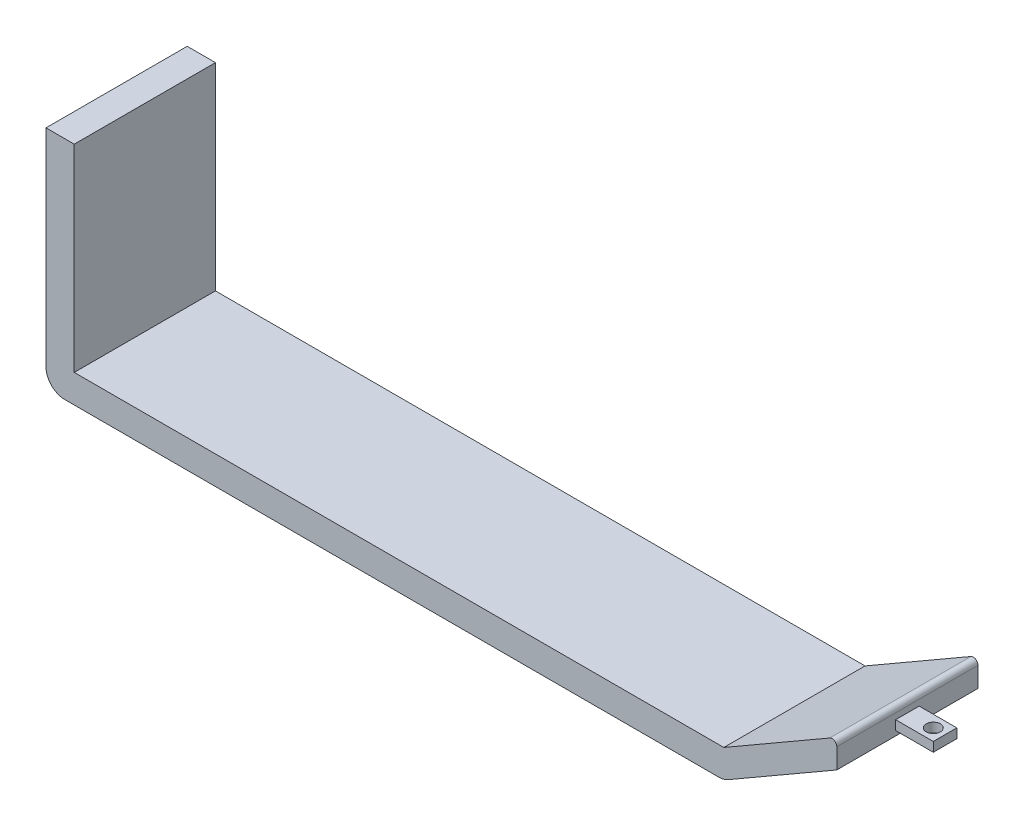
ISO-10303-21;
HEADER;
FILE_DESCRIPTION(('STEP AP214'),'2;1');
FILE_NAME('part.step','',(''),(''),'','','');
FILE_SCHEMA(('AUTOMOTIVE_DESIGN { 1 0 10303 214 1 1 1 1 }'));
ENDSEC;
DATA;
#1=APPLICATION_CONTEXT('core data for automotive mechanical design processes');
#2=APPLICATION_PROTOCOL_DEFINITION('international standard','automotive_design',2000,#1);
#3=PRODUCT_CONTEXT('',#1,'mechanical');
#4=PRODUCT('Part','Part','',(#3));
#5=PRODUCT_RELATED_PRODUCT_CATEGORY('part','',(#4));
#6=PRODUCT_DEFINITION_FORMATION('','',#4);
#7=PRODUCT_DEFINITION_CONTEXT('part definition',#1,'design');
#8=PRODUCT_DEFINITION('design','',#6,#7);
#9=PRODUCT_DEFINITION_SHAPE('','',#8);
#10=(LENGTH_UNIT() NAMED_UNIT(*) SI_UNIT(.MILLI.,.METRE.));
#11=(NAMED_UNIT(*) PLANE_ANGLE_UNIT() SI_UNIT($,.RADIAN.));
#12=(NAMED_UNIT(*) SI_UNIT($,.STERADIAN.) SOLID_ANGLE_UNIT());
#13=UNCERTAINTY_MEASURE_WITH_UNIT(LENGTH_MEASURE(1.E-05),#10,'distance_accuracy_value','');
#14=(GEOMETRIC_REPRESENTATION_CONTEXT(3) GLOBAL_UNCERTAINTY_ASSIGNED_CONTEXT((#13)) GLOBAL_UNIT_ASSIGNED_CONTEXT((#10,
#11,#12)) REPRESENTATION_CONTEXT('',''));
#15=CARTESIAN_POINT('',(0.,0.,0.));
#16=DIRECTION('',(0.,0.,1.));
#17=DIRECTION('',(1.,0.,0.));
#18=AXIS2_PLACEMENT_3D('',#15,#16,#17);
#19=CARTESIAN_POINT('',(2133.6,2.48689957516037E-11,381.));
#20=DIRECTION('',(-1.,0.,0.));
#21=DIRECTION('',(0.,-1.,0.));
#22=AXIS2_PLACEMENT_3D('',#19,#20,#21);
#23=PLANE('',#22);
#24=DIRECTION('',(0.,1.,0.));
#25=VECTOR('',#24,1.);
#26=CARTESIAN_POINT('',(2133.6,2.48689957516037E-11,0.));
#27=LINE('',#26,#25);
#28=CARTESIAN_POINT('',(2133.6,175.976362048999,0.));
#29=VERTEX_POINT('',#28);
#30=CARTESIAN_POINT('',(2133.6,230.179316792874,0.));
#31=VERTEX_POINT('',#30);
#32=EDGE_CURVE('E253',#29,#31,#27,.T.);
#33=ORIENTED_EDGE('',*,*,#32,.T.);
#34=DIRECTION('',(0.,0.,-1.));
#35=VECTOR('',#34,1.);
#36=CARTESIAN_POINT('',(2133.6,230.179316792874,381.));
#37=LINE('',#36,#35);
#38=CARTESIAN_POINT('',(2133.6,230.179316792874,381.));
#39=VERTEX_POINT('',#38);
#40=EDGE_CURVE('E298',#31,#39,#37,.F.);
#41=ORIENTED_EDGE('',*,*,#40,.T.);
#42=DIRECTION('',(0.,1.,0.));
#43=VECTOR('',#42,1.);
#44=CARTESIAN_POINT('',(2133.6,2.48689957516037E-11,381.));
#45=LINE('',#44,#43);
#46=CARTESIAN_POINT('',(2133.6,175.976362048999,381.));
#47=VERTEX_POINT('',#46);
#48=EDGE_CURVE('E232',#47,#39,#45,.T.);
#49=ORIENTED_EDGE('',*,*,#48,.F.);
#50=DIRECTION('',(0.,0.,-1.));
#51=VECTOR('',#50,1.);
#52=CARTESIAN_POINT('',(2133.6,175.976362048999,381.));
#53=LINE('',#52,#51);
#54=EDGE_CURVE('E279',#47,#29,#53,.T.);
#55=ORIENTED_EDGE('',*,*,#54,.T.);
#56=EDGE_LOOP('',(#33,#41,#49,#55));
#57=FACE_BOUND('',#56,.T.);
#58=DIRECTION('',(0.,-1.,0.));
#59=VECTOR('',#58,1.);
#60=CARTESIAN_POINT('',(2133.6,188.676362048999,222.25));
#61=LINE('',#60,#59);
#62=CARTESIAN_POINT('',(2133.6,214.076362048999,222.25));
#63=VERTEX_POINT('',#62);
#64=CARTESIAN_POINT('',(2133.6,188.676362048999,222.25));
#65=VERTEX_POINT('',#64);
#66=EDGE_CURVE('E187',#63,#65,#61,.T.);
#67=ORIENTED_EDGE('',*,*,#66,.F.);
#68=DIRECTION('',(0.,0.,1.));
#69=VECTOR('',#68,1.);
#70=CARTESIAN_POINT('',(2133.6,214.076362048999,222.25));
#71=LINE('',#70,#69);
#72=CARTESIAN_POINT('',(2133.6,214.076362048999,158.75));
#73=VERTEX_POINT('',#72);
#74=EDGE_CURVE('E184',#73,#63,#71,.T.);
#75=ORIENTED_EDGE('',*,*,#74,.F.);
#76=DIRECTION('',(0.,1.,0.));
#77=VECTOR('',#76,1.);
#78=CARTESIAN_POINT('',(2133.6,188.676362048999,158.75));
#79=LINE('',#78,#77);
#80=CARTESIAN_POINT('',(2133.6,188.676362048999,158.75));
#81=VERTEX_POINT('',#80);
#82=EDGE_CURVE('E57',#81,#73,#79,.T.);
#83=ORIENTED_EDGE('',*,*,#82,.F.);
#84=DIRECTION('',(0.,0.,-1.));
#85=VECTOR('',#84,1.);
#86=CARTESIAN_POINT('',(2133.6,188.676362048999,222.25));
#87=LINE('',#86,#85);
#88=EDGE_CURVE('E52',#65,#81,#87,.T.);
#89=ORIENTED_EDGE('',*,*,#88,.F.);
#90=EDGE_LOOP('',(#67,#75,#83,#89));
#91=FACE_BOUND('',#90,.T.);
#92=ADVANCED_FACE('F37',(#57,#91),#23,.F.);
#93=CARTESIAN_POINT('',(0.,0.,381.));
#94=DIRECTION('',(-1.,0.,0.));
#95=DIRECTION('',(0.,0.,1.));
#96=AXIS2_PLACEMENT_3D('',#93,#94,#95);
#97=PLANE('',#96);
#98=DIRECTION('',(0.,1.,0.));
#99=VECTOR('',#98,1.);
#100=CARTESIAN_POINT('',(0.,0.,0.));
#101=LINE('',#100,#99);
#102=CARTESIAN_POINT('',(0.,50.8,0.));
#103=VERTEX_POINT('',#102);
#104=CARTESIAN_POINT('',(0.,609.6,0.));
#105=VERTEX_POINT('',#104);
#106=EDGE_CURVE('E268',#103,#105,#101,.T.);
#107=ORIENTED_EDGE('',*,*,#106,.F.);
#108=DIRECTION('',(0.,0.,-1.));
#109=VECTOR('',#108,1.);
#110=CARTESIAN_POINT('',(0.,50.8,381.));
#111=LINE('',#110,#109);
#112=CARTESIAN_POINT('',(0.,50.8,158.75));
#113=VERTEX_POINT('',#112);
#114=EDGE_CURVE('E45',#103,#113,#111,.F.);
#115=ORIENTED_EDGE('',*,*,#114,.T.);
#116=DIRECTION('',(0.,-1.,0.));
#117=VECTOR('',#116,1.);
#118=CARTESIAN_POINT('',(0.,50.8,158.75));
#119=LINE('',#118,#117);
#120=CARTESIAN_POINT('',(0.,76.2,158.75));
#121=VERTEX_POINT('',#120);
#122=EDGE_CURVE('E199',#121,#113,#119,.T.);
#123=ORIENTED_EDGE('',*,*,#122,.F.);
#124=DIRECTION('',(0.,0.,-1.));
#125=VECTOR('',#124,1.);
#126=CARTESIAN_POINT('',(0.,76.2,158.75));
#127=LINE('',#126,#125);
#128=CARTESIAN_POINT('',(0.,76.2,222.25));
#129=VERTEX_POINT('',#128);
#130=EDGE_CURVE('E204',#129,#121,#127,.T.);
#131=ORIENTED_EDGE('',*,*,#130,.F.);
#132=DIRECTION('',(0.,1.,0.));
#133=VECTOR('',#132,1.);
#134=CARTESIAN_POINT('',(0.,50.8,222.25));
#135=LINE('',#134,#133);
#136=CARTESIAN_POINT('',(0.,50.8,222.25));
#137=VERTEX_POINT('',#136);
#138=EDGE_CURVE('E215',#137,#129,#135,.T.);
#139=ORIENTED_EDGE('',*,*,#138,.F.);
#140=DIRECTION('',(0.,0.,-1.));
#141=VECTOR('',#140,1.);
#142=CARTESIAN_POINT('',(0.,50.8,381.));
#143=LINE('',#142,#141);
#144=CARTESIAN_POINT('',(0.,50.8,381.));
#145=VERTEX_POINT('',#144);
#146=EDGE_CURVE('E307',#137,#145,#143,.F.);
#147=ORIENTED_EDGE('',*,*,#146,.T.);
#148=DIRECTION('',(0.,1.,0.));
#149=VECTOR('',#148,1.);
#150=CARTESIAN_POINT('',(0.,0.,381.));
#151=LINE('',#150,#149);
#152=CARTESIAN_POINT('',(0.,609.6,381.));
#153=VERTEX_POINT('',#152);
#154=EDGE_CURVE('E247',#145,#153,#151,.T.);
#155=ORIENTED_EDGE('',*,*,#154,.T.);
#156=DIRECTION('',(0.,0.,-1.));
#157=VECTOR('',#156,1.);
#158=CARTESIAN_POINT('',(0.,609.6,381.));
#159=LINE('',#158,#157);
#160=EDGE_CURVE('E251',#153,#105,#159,.T.);
#161=ORIENTED_EDGE('',*,*,#160,.T.);
#162=EDGE_LOOP('',(#107,#115,#123,#131,#139,#147,#155,#161));
#163=FACE_BOUND('',#162,.T.);
#164=ADVANCED_FACE('F312',(#163),#97,.T.);
#165=CARTESIAN_POINT('',(457.200000000003,-791.893629220492,381.));
#166=DIRECTION('',(-0.500000000000001,0.866025403784438,0.));
#167=DIRECTION('',(-0.866025403784438,-0.500000000000002,0.));
#168=AXIS2_PLACEMENT_3D('',#165,#166,#167);
#169=PLANE('',#168);
#170=DIRECTION('',(0.866025403784438,0.500000000000002,0.));
#171=VECTOR('',#170,1.);
#172=CARTESIAN_POINT('',(457.200000000003,-791.893629220492,381.));
#173=LINE('',#172,#171);
#174=CARTESIAN_POINT('',(1840.5881810245,6.80590948775051,381.));
#175=VERTEX_POINT('',#174);
#176=EDGE_CURVE('E230',#175,#47,#173,.T.);
#177=ORIENTED_EDGE('',*,*,#176,.F.);
#178=DIRECTION('',(0.,0.,-1.));
#179=VECTOR('',#178,1.);
#180=CARTESIAN_POINT('',(1840.5881810245,6.80590948775062,381.));
#181=LINE('',#180,#179);
#182=CARTESIAN_POINT('',(1840.5881810245,6.80590948775051,0.));
#183=VERTEX_POINT('',#182);
#184=EDGE_CURVE('E282',#175,#183,#181,.T.);
#185=ORIENTED_EDGE('',*,*,#184,.T.);
#186=DIRECTION('',(0.866025403784438,0.500000000000002,0.));
#187=VECTOR('',#186,1.);
#188=CARTESIAN_POINT('',(457.200000000003,-791.893629220492,0.));
#189=LINE('',#188,#187);
#190=EDGE_CURVE('E229',#183,#29,#189,.T.);
#191=ORIENTED_EDGE('',*,*,#190,.T.);
#192=ORIENTED_EDGE('',*,*,#54,.F.);
#193=EDGE_LOOP('',(#177,#185,#191,#192));
#194=FACE_BOUND('',#193,.T.);
#195=ADVANCED_FACE('F355',(#194),#169,.F.);
#196=CARTESIAN_POINT('',(424.204432115816,-734.743629220493,381.));
#197=DIRECTION('',(-0.500000000000001,0.866025403784438,0.));
#198=DIRECTION('',(-0.866025403784438,-0.500000000000002,0.));
#199=AXIS2_PLACEMENT_3D('',#196,#197,#198);
#200=PLANE('',#199);
#201=DIRECTION('',(0.866025403784438,0.500000000000002,0.));
#202=VECTOR('',#201,1.);
#203=CARTESIAN_POINT('',(424.204432115816,-734.743629220493,381.));
#204=LINE('',#203,#202);
#205=CARTESIAN_POINT('',(1828.8,76.2,381.));
#206=VERTEX_POINT('',#205);
#207=CARTESIAN_POINT('',(2114.55,241.177839420936,381.));
#208=VERTEX_POINT('',#207);
#209=EDGE_CURVE('E236',#206,#208,#204,.T.);
#210=ORIENTED_EDGE('',*,*,#209,.T.);
#211=DIRECTION('',(0.,0.,-1.));
#212=VECTOR('',#211,1.);
#213=CARTESIAN_POINT('',(2114.55,241.177839420936,0.));
#214=LINE('',#213,#212);
#215=CARTESIAN_POINT('',(2114.55,241.177839420936,0.));
#216=VERTEX_POINT('',#215);
#217=EDGE_CURVE('E293',#208,#216,#214,.T.);
#218=ORIENTED_EDGE('',*,*,#217,.T.);
#219=DIRECTION('',(0.866025403784438,0.500000000000002,0.));
#220=VECTOR('',#219,1.);
#221=CARTESIAN_POINT('',(424.204432115816,-734.743629220493,0.));
#222=LINE('',#221,#220);
#223=CARTESIAN_POINT('',(1828.8,76.2,0.));
#224=VERTEX_POINT('',#223);
#225=EDGE_CURVE('E256',#224,#216,#222,.T.);
#226=ORIENTED_EDGE('',*,*,#225,.F.);
#227=DIRECTION('',(0.,0.,-1.));
#228=VECTOR('',#227,1.);
#229=CARTESIAN_POINT('',(1828.8,76.2,381.));
#230=LINE('',#229,#228);
#231=EDGE_CURVE('E277',#206,#224,#230,.T.);
#232=ORIENTED_EDGE('',*,*,#231,.F.);
#233=EDGE_LOOP('',(#210,#218,#226,#232));
#234=FACE_BOUND('',#233,.T.);
#235=ADVANCED_FACE('F368',(#234),#200,.T.);
#236=CARTESIAN_POINT('',(0.,76.2,381.));
#237=DIRECTION('',(0.,1.,0.));
#238=DIRECTION('',(0.,0.,1.));
#239=AXIS2_PLACEMENT_3D('',#236,#237,#238);
#240=PLANE('',#239);
#241=DIRECTION('',(1.,0.,0.));
#242=VECTOR('',#241,1.);
#243=CARTESIAN_POINT('',(0.,76.2,0.));
#244=LINE('',#243,#242);
#245=CARTESIAN_POINT('',(76.2,76.2,0.));
#246=VERTEX_POINT('',#245);
#247=EDGE_CURVE('E259',#246,#224,#244,.T.);
#248=ORIENTED_EDGE('',*,*,#247,.F.);
#249=DIRECTION('',(0.,0.,-1.));
#250=VECTOR('',#249,1.);
#251=CARTESIAN_POINT('',(76.2,76.2,381.));
#252=LINE('',#251,#250);
#253=CARTESIAN_POINT('',(76.2,76.2,381.));
#254=VERTEX_POINT('',#253);
#255=EDGE_CURVE('E275',#254,#246,#252,.T.);
#256=ORIENTED_EDGE('',*,*,#255,.F.);
#257=DIRECTION('',(1.,0.,0.));
#258=VECTOR('',#257,1.);
#259=CARTESIAN_POINT('',(0.,76.2,381.));
#260=LINE('',#259,#258);
#261=EDGE_CURVE('E239',#254,#206,#260,.T.);
#262=ORIENTED_EDGE('',*,*,#261,.T.);
#263=ORIENTED_EDGE('',*,*,#231,.T.);
#264=EDGE_LOOP('',(#248,#256,#262,#263));
#265=FACE_BOUND('',#264,.T.);
#266=ADVANCED_FACE('F370',(#265),#240,.T.);
#267=CARTESIAN_POINT('',(76.2,0.,381.));
#268=DIRECTION('',(-1.,0.,0.));
#269=DIRECTION('',(0.,0.,1.));
#270=AXIS2_PLACEMENT_3D('',#267,#268,#269);
#271=PLANE('',#270);
#272=DIRECTION('',(0.,1.,0.));
#273=VECTOR('',#272,1.);
#274=CARTESIAN_POINT('',(76.2,0.,0.));
#275=LINE('',#274,#273);
#276=CARTESIAN_POINT('',(76.2,609.6,0.));
#277=VERTEX_POINT('',#276);
#278=EDGE_CURVE('E262',#246,#277,#275,.T.);
#279=ORIENTED_EDGE('',*,*,#278,.T.);
#280=DIRECTION('',(0.,0.,-1.));
#281=VECTOR('',#280,1.);
#282=CARTESIAN_POINT('',(76.2,609.6,381.));
#283=LINE('',#282,#281);
#284=CARTESIAN_POINT('',(76.2,609.6,381.));
#285=VERTEX_POINT('',#284);
#286=EDGE_CURVE('E273',#285,#277,#283,.T.);
#287=ORIENTED_EDGE('',*,*,#286,.F.);
#288=DIRECTION('',(0.,1.,0.));
#289=VECTOR('',#288,1.);
#290=CARTESIAN_POINT('',(76.2,0.,381.));
#291=LINE('',#290,#289);
#292=EDGE_CURVE('E242',#254,#285,#291,.T.);
#293=ORIENTED_EDGE('',*,*,#292,.F.);
#294=ORIENTED_EDGE('',*,*,#255,.T.);
#295=EDGE_LOOP('',(#279,#287,#293,#294));
#296=FACE_BOUND('',#295,.T.);
#297=ADVANCED_FACE('F372',(#296),#271,.F.);
#298=CARTESIAN_POINT('',(0.,609.6,381.));
#299=DIRECTION('',(0.,1.,0.));
#300=DIRECTION('',(0.,0.,1.));
#301=AXIS2_PLACEMENT_3D('',#298,#299,#300);
#302=PLANE('',#301);
#303=DIRECTION('',(1.,0.,0.));
#304=VECTOR('',#303,1.);
#305=CARTESIAN_POINT('',(0.,609.6,0.));
#306=LINE('',#305,#304);
#307=EDGE_CURVE('E265',#105,#277,#306,.T.);
#308=ORIENTED_EDGE('',*,*,#307,.F.);
#309=ORIENTED_EDGE('',*,*,#160,.F.);
#310=DIRECTION('',(1.,0.,0.));
#311=VECTOR('',#310,1.);
#312=CARTESIAN_POINT('',(0.,609.6,381.));
#313=LINE('',#312,#311);
#314=EDGE_CURVE('E244',#153,#285,#313,.T.);
#315=ORIENTED_EDGE('',*,*,#314,.T.);
#316=ORIENTED_EDGE('',*,*,#286,.T.);
#317=EDGE_LOOP('',(#308,#309,#315,#316));
#318=FACE_BOUND('',#317,.T.);
#319=ADVANCED_FACE('F339',(#318),#302,.T.);
#320=CARTESIAN_POINT('',(0.,0.,381.));
#321=DIRECTION('',(0.,1.,0.));
#322=DIRECTION('',(0.,0.,1.));
#323=AXIS2_PLACEMENT_3D('',#320,#321,#322);
#324=PLANE('',#323);
#325=DIRECTION('',(1.,0.,0.));
#326=VECTOR('',#325,1.);
#327=CARTESIAN_POINT('',(0.,0.,381.));
#328=LINE('',#327,#326);
#329=CARTESIAN_POINT('',(50.8,0.,381.));
#330=VERTEX_POINT('',#329);
#331=CARTESIAN_POINT('',(1815.1881810245,0.,381.));
#332=VERTEX_POINT('',#331);
#333=EDGE_CURVE('E249',#330,#332,#328,.T.);
#334=ORIENTED_EDGE('',*,*,#333,.F.);
#335=DIRECTION('',(0.,0.,-1.));
#336=VECTOR('',#335,1.);
#337=CARTESIAN_POINT('',(50.8,0.,0.));
#338=LINE('',#337,#336);
#339=CARTESIAN_POINT('',(50.8,0.,0.));
#340=VERTEX_POINT('',#339);
#341=EDGE_CURVE('E302',#330,#340,#338,.T.);
#342=ORIENTED_EDGE('',*,*,#341,.T.);
#343=DIRECTION('',(1.,0.,0.));
#344=VECTOR('',#343,1.);
#345=CARTESIAN_POINT('',(0.,0.,0.));
#346=LINE('',#345,#344);
#347=CARTESIAN_POINT('',(1815.1881810245,0.,0.));
#348=VERTEX_POINT('',#347);
#349=EDGE_CURVE('E233',#340,#348,#346,.T.);
#350=ORIENTED_EDGE('',*,*,#349,.T.);
#351=DIRECTION('',(0.,0.,-1.));
#352=VECTOR('',#351,1.);
#353=CARTESIAN_POINT('',(1815.1881810245,0.,381.));
#354=LINE('',#353,#352);
#355=EDGE_CURVE('E288',#348,#332,#354,.F.);
#356=ORIENTED_EDGE('',*,*,#355,.T.);
#357=EDGE_LOOP('',(#334,#342,#350,#356));
#358=FACE_BOUND('',#357,.T.);
#359=ADVANCED_FACE('F346',(#358),#324,.F.);
#360=CARTESIAN_POINT('',(0.,0.,381.));
#361=DIRECTION('',(0.,0.,1.));
#362=DIRECTION('',(1.,0.,0.));
#363=AXIS2_PLACEMENT_3D('',#360,#361,#362);
#364=PLANE('',#363);
#365=ORIENTED_EDGE('',*,*,#154,.F.);
#366=CARTESIAN_POINT('',(50.8,50.8,381.));
#367=DIRECTION('',(0.,0.,1.));
#368=DIRECTION('',(1.,0.,0.));
#369=AXIS2_PLACEMENT_3D('',#366,#367,#368);
#370=CIRCLE('',#369,50.8);
#371=EDGE_CURVE('E11',#145,#330,#370,.T.);
#372=ORIENTED_EDGE('',*,*,#371,.T.);
#373=ORIENTED_EDGE('',*,*,#333,.T.);
#374=CARTESIAN_POINT('',(1815.1881810245,50.8,381.));
#375=DIRECTION('',(0.,0.,1.));
#376=DIRECTION('',(1.,0.,0.));
#377=AXIS2_PLACEMENT_3D('',#374,#375,#376);
#378=CIRCLE('',#377,50.8);
#379=EDGE_CURVE('E291',#332,#175,#378,.T.);
#380=ORIENTED_EDGE('',*,*,#379,.T.);
#381=ORIENTED_EDGE('',*,*,#176,.T.);
#382=ORIENTED_EDGE('',*,*,#48,.T.);
#383=CARTESIAN_POINT('',(2120.9,230.179316792873,381.));
#384=DIRECTION('',(0.,0.,1.));
#385=DIRECTION('',(1.,0.,0.));
#386=AXIS2_PLACEMENT_3D('',#383,#384,#385);
#387=CIRCLE('',#386,12.7);
#388=EDGE_CURVE('E300',#39,#208,#387,.T.);
#389=ORIENTED_EDGE('',*,*,#388,.T.);
#390=ORIENTED_EDGE('',*,*,#209,.F.);
#391=ORIENTED_EDGE('',*,*,#261,.F.);
#392=ORIENTED_EDGE('',*,*,#292,.T.);
#393=ORIENTED_EDGE('',*,*,#314,.F.);
#394=EDGE_LOOP('',(#365,#372,#373,#380,#381,#382,#389,#390,#391,#392,#393));
#395=FACE_BOUND('',#394,.T.);
#396=ADVANCED_FACE('F332',(#395),#364,.T.);
#397=CARTESIAN_POINT('',(0.,0.,0.));
#398=DIRECTION('',(0.,0.,1.));
#399=DIRECTION('',(1.,0.,0.));
#400=AXIS2_PLACEMENT_3D('',#397,#398,#399);
#401=PLANE('',#400);
#402=ORIENTED_EDGE('',*,*,#349,.F.);
#403=CARTESIAN_POINT('',(50.8,50.8,0.));
#404=DIRECTION('',(0.,0.,1.));
#405=DIRECTION('',(1.,0.,0.));
#406=AXIS2_PLACEMENT_3D('',#403,#404,#405);
#407=CIRCLE('',#406,50.8);
#408=EDGE_CURVE('E305',#340,#103,#407,.F.);
#409=ORIENTED_EDGE('',*,*,#408,.T.);
#410=ORIENTED_EDGE('',*,*,#106,.T.);
#411=ORIENTED_EDGE('',*,*,#307,.T.);
#412=ORIENTED_EDGE('',*,*,#278,.F.);
#413=ORIENTED_EDGE('',*,*,#247,.T.);
#414=ORIENTED_EDGE('',*,*,#225,.T.);
#415=CARTESIAN_POINT('',(2120.9,230.179316792873,0.));
#416=DIRECTION('',(0.,0.,1.));
#417=DIRECTION('',(1.,0.,0.));
#418=AXIS2_PLACEMENT_3D('',#415,#416,#417);
#419=CIRCLE('',#418,12.7);
#420=EDGE_CURVE('E296',#216,#31,#419,.F.);
#421=ORIENTED_EDGE('',*,*,#420,.T.);
#422=ORIENTED_EDGE('',*,*,#32,.F.);
#423=ORIENTED_EDGE('',*,*,#190,.F.);
#424=CARTESIAN_POINT('',(1815.1881810245,50.8,0.));
#425=DIRECTION('',(0.,0.,1.));
#426=DIRECTION('',(1.,0.,0.));
#427=AXIS2_PLACEMENT_3D('',#424,#425,#426);
#428=CIRCLE('',#427,50.8);
#429=EDGE_CURVE('E285',#183,#348,#428,.F.);
#430=ORIENTED_EDGE('',*,*,#429,.T.);
#431=EDGE_LOOP('',(#402,#409,#410,#411,#412,#413,#414,#421,#422,#423,#430));
#432=FACE_BOUND('',#431,.T.);
#433=ADVANCED_FACE('F343',(#432),#401,.F.);
#434=CARTESIAN_POINT('',(-101.6,50.8,158.75));
#435=DIRECTION('',(0.,0.,1.));
#436=DIRECTION('',(1.,0.,0.));
#437=AXIS2_PLACEMENT_3D('',#434,#435,#436);
#438=PLANE('',#437);
#439=ORIENTED_EDGE('',*,*,#122,.T.);
#440=DIRECTION('',(1.,0.,0.));
#441=VECTOR('',#440,1.);
#442=CARTESIAN_POINT('',(-101.6,50.8,158.75));
#443=LINE('',#442,#441);
#444=CARTESIAN_POINT('',(-101.6,50.8,158.75));
#445=VERTEX_POINT('',#444);
#446=EDGE_CURVE('E226',#445,#113,#443,.T.);
#447=ORIENTED_EDGE('',*,*,#446,.F.);
#448=DIRECTION('',(0.,-1.,0.));
#449=VECTOR('',#448,1.);
#450=CARTESIAN_POINT('',(-101.6,50.8,158.75));
#451=LINE('',#450,#449);
#452=CARTESIAN_POINT('',(-101.6,76.2,158.75));
#453=VERTEX_POINT('',#452);
#454=EDGE_CURVE('E200',#453,#445,#451,.T.);
#455=ORIENTED_EDGE('',*,*,#454,.F.);
#456=DIRECTION('',(1.,0.,0.));
#457=VECTOR('',#456,1.);
#458=CARTESIAN_POINT('',(-101.6,76.2,158.75));
#459=LINE('',#458,#457);
#460=EDGE_CURVE('E210',#453,#121,#459,.T.);
#461=ORIENTED_EDGE('',*,*,#460,.T.);
#462=EDGE_LOOP('',(#439,#447,#455,#461));
#463=FACE_BOUND('',#462,.T.);
#464=ADVANCED_FACE('F322',(#463),#438,.F.);
#465=CARTESIAN_POINT('',(-101.6,50.8,158.75));
#466=DIRECTION('',(0.,1.,0.));
#467=DIRECTION('',(0.,0.,1.));
#468=AXIS2_PLACEMENT_3D('',#465,#466,#467);
#469=PLANE('',#468);
#470=CARTESIAN_POINT('',(-63.5,50.8,190.5));
#471=DIRECTION('',(0.,1.,0.));
#472=DIRECTION('',(0.,0.,1.));
#473=AXIS2_PLACEMENT_3D('',#470,#471,#472);
#474=CIRCLE('',#473,19.05);
#475=CARTESIAN_POINT('',(-63.5,50.8,209.55));
#476=VERTEX_POINT('',#475);
#477=EDGE_CURVE('E191',#476,#476,#474,.F.);
#478=ORIENTED_EDGE('',*,*,#477,.F.);
#479=EDGE_LOOP('',(#478));
#480=FACE_BOUND('',#479,.T.);
#481=DIRECTION('',(0.,0.,1.));
#482=VECTOR('',#481,1.);
#483=CARTESIAN_POINT('',(0.,50.8,158.75));
#484=LINE('',#483,#482);
#485=EDGE_CURVE('E213',#113,#137,#484,.T.);
#486=ORIENTED_EDGE('',*,*,#485,.T.);
#487=DIRECTION('',(1.,0.,0.));
#488=VECTOR('',#487,1.);
#489=CARTESIAN_POINT('',(-101.6,50.8,222.25));
#490=LINE('',#489,#488);
#491=CARTESIAN_POINT('',(-101.6,50.8,222.25));
#492=VERTEX_POINT('',#491);
#493=EDGE_CURVE('E223',#492,#137,#490,.T.);
#494=ORIENTED_EDGE('',*,*,#493,.F.);
#495=DIRECTION('',(0.,0.,1.));
#496=VECTOR('',#495,1.);
#497=CARTESIAN_POINT('',(-101.6,50.8,158.75));
#498=LINE('',#497,#496);
#499=EDGE_CURVE('E203',#445,#492,#498,.T.);
#500=ORIENTED_EDGE('',*,*,#499,.F.);
#501=ORIENTED_EDGE('',*,*,#446,.T.);
#502=EDGE_LOOP('',(#486,#494,#500,#501));
#503=FACE_BOUND('',#502,.T.);
#504=ADVANCED_FACE('F318',(#480,#503),#469,.F.);
#505=CARTESIAN_POINT('',(-101.6,50.8,222.25));
#506=DIRECTION('',(0.,0.,-1.));
#507=DIRECTION('',(0.,1.,0.));
#508=AXIS2_PLACEMENT_3D('',#505,#506,#507);
#509=PLANE('',#508);
#510=ORIENTED_EDGE('',*,*,#138,.T.);
#511=DIRECTION('',(1.,0.,0.));
#512=VECTOR('',#511,1.);
#513=CARTESIAN_POINT('',(-101.6,76.2,222.25));
#514=LINE('',#513,#512);
#515=CARTESIAN_POINT('',(-101.6,76.2,222.25));
#516=VERTEX_POINT('',#515);
#517=EDGE_CURVE('E221',#516,#129,#514,.T.);
#518=ORIENTED_EDGE('',*,*,#517,.F.);
#519=DIRECTION('',(0.,1.,0.));
#520=VECTOR('',#519,1.);
#521=CARTESIAN_POINT('',(-101.6,50.8,222.25));
#522=LINE('',#521,#520);
#523=EDGE_CURVE('E206',#492,#516,#522,.T.);
#524=ORIENTED_EDGE('',*,*,#523,.F.);
#525=ORIENTED_EDGE('',*,*,#493,.T.);
#526=EDGE_LOOP('',(#510,#518,#524,#525));
#527=FACE_BOUND('',#526,.T.);
#528=ADVANCED_FACE('F419',(#527),#509,.F.);
#529=CARTESIAN_POINT('',(-101.6,76.2,158.75));
#530=DIRECTION('',(0.,-1.,0.));
#531=DIRECTION('',(0.,0.,-1.));
#532=AXIS2_PLACEMENT_3D('',#529,#530,#531);
#533=PLANE('',#532);
#534=CARTESIAN_POINT('',(-63.5,76.1999999999999,190.5));
#535=DIRECTION('',(0.,1.,0.));
#536=DIRECTION('',(0.,0.,1.));
#537=AXIS2_PLACEMENT_3D('',#534,#535,#536);
#538=CIRCLE('',#537,19.05);
#539=CARTESIAN_POINT('',(-63.5,76.1999999999999,209.55));
#540=VERTEX_POINT('',#539);
#541=EDGE_CURVE('E188',#540,#540,#538,.T.);
#542=ORIENTED_EDGE('',*,*,#541,.F.);
#543=EDGE_LOOP('',(#542));
#544=FACE_BOUND('',#543,.T.);
#545=ORIENTED_EDGE('',*,*,#130,.T.);
#546=ORIENTED_EDGE('',*,*,#460,.F.);
#547=DIRECTION('',(0.,0.,-1.));
#548=VECTOR('',#547,1.);
#549=CARTESIAN_POINT('',(-101.6,76.2,158.75));
#550=LINE('',#549,#548);
#551=EDGE_CURVE('E208',#516,#453,#550,.T.);
#552=ORIENTED_EDGE('',*,*,#551,.F.);
#553=ORIENTED_EDGE('',*,*,#517,.T.);
#554=EDGE_LOOP('',(#545,#546,#552,#553));
#555=FACE_BOUND('',#554,.T.);
#556=ADVANCED_FACE('F415',(#544,#555),#533,.F.);
#557=CARTESIAN_POINT('',(-101.6,0.,0.));
#558=DIRECTION('',(1.,0.,0.));
#559=DIRECTION('',(0.,0.,-1.));
#560=AXIS2_PLACEMENT_3D('',#557,#558,#559);
#561=PLANE('',#560);
#562=ORIENTED_EDGE('',*,*,#454,.T.);
#563=ORIENTED_EDGE('',*,*,#499,.T.);
#564=ORIENTED_EDGE('',*,*,#523,.T.);
#565=ORIENTED_EDGE('',*,*,#551,.T.);
#566=EDGE_LOOP('',(#562,#563,#564,#565));
#567=FACE_BOUND('',#566,.T.);
#568=ADVANCED_FACE('F411',(#567),#561,.F.);
#569=CARTESIAN_POINT('',(-63.5,-3.08153672641494,190.5));
#570=DIRECTION('',(0.,1.,0.));
#571=DIRECTION('',(0.,0.,1.));
#572=AXIS2_PLACEMENT_3D('',#569,#570,#571);
#573=CYLINDRICAL_SURFACE('',#572,19.05);
#574=CARTESIAN_POINT('',(-63.5,50.8,209.55));
#575=CARTESIAN_POINT('',(-63.5,51.0645833333334,209.55));
#576=CARTESIAN_POINT('',(-63.5,51.3291666666667,209.55));
#577=CARTESIAN_POINT('',(-63.5,51.8583333333333,209.55));
#578=CARTESIAN_POINT('',(-63.5,52.1229166666667,209.55));
#579=CARTESIAN_POINT('',(-63.5,52.6520833333333,209.55));
#580=CARTESIAN_POINT('',(-63.5,52.9166666666667,209.55));
#581=CARTESIAN_POINT('',(-63.5,53.4458333333333,209.55));
#582=CARTESIAN_POINT('',(-63.5,53.7104166666667,209.55));
#583=CARTESIAN_POINT('',(-63.5,54.2395833333333,209.55));
#584=CARTESIAN_POINT('',(-63.5,54.5041666666667,209.55));
#585=CARTESIAN_POINT('',(-63.5,55.0333333333333,209.55));
#586=CARTESIAN_POINT('',(-63.5,55.2979166666667,209.55));
#587=CARTESIAN_POINT('',(-63.5,55.8270833333333,209.55));
#588=CARTESIAN_POINT('',(-63.5,56.0916666666667,209.55));
#589=CARTESIAN_POINT('',(-63.5,56.6208333333333,209.55));
#590=CARTESIAN_POINT('',(-63.5,56.8854166666667,209.55));
#591=CARTESIAN_POINT('',(-63.5,57.4145833333333,209.55));
#592=CARTESIAN_POINT('',(-63.5,57.6791666666667,209.55));
#593=CARTESIAN_POINT('',(-63.5,58.2083333333333,209.55));
#594=CARTESIAN_POINT('',(-63.5,58.4729166666667,209.55));
#595=CARTESIAN_POINT('',(-63.5,59.0020833333333,209.55));
#596=CARTESIAN_POINT('',(-63.5,59.2666666666667,209.55));
#597=CARTESIAN_POINT('',(-63.5,59.7958333333333,209.55));
#598=CARTESIAN_POINT('',(-63.5,60.0604166666667,209.55));
#599=CARTESIAN_POINT('',(-63.5,60.5895833333333,209.55));
#600=CARTESIAN_POINT('',(-63.5,60.8541666666667,209.55));
#601=CARTESIAN_POINT('',(-63.5,61.3833333333333,209.55));
#602=CARTESIAN_POINT('',(-63.5,61.6479166666667,209.55));
#603=CARTESIAN_POINT('',(-63.5,62.1770833333333,209.55));
#604=CARTESIAN_POINT('',(-63.5,62.4416666666666,209.55));
#605=CARTESIAN_POINT('',(-63.5,62.9708333333333,209.55));
#606=CARTESIAN_POINT('',(-63.5,63.2354166666666,209.55));
#607=CARTESIAN_POINT('',(-63.5,63.7645833333333,209.55));
#608=CARTESIAN_POINT('',(-63.5,64.0291666666666,209.55));
#609=CARTESIAN_POINT('',(-63.5,64.5583333333333,209.55));
#610=CARTESIAN_POINT('',(-63.5,64.8229166666666,209.55));
#611=CARTESIAN_POINT('',(-63.5,65.3520833333333,209.55));
#612=CARTESIAN_POINT('',(-63.5,65.6166666666666,209.55));
#613=CARTESIAN_POINT('',(-63.5,66.1458333333333,209.55));
#614=CARTESIAN_POINT('',(-63.5,66.4104166666666,209.55));
#615=CARTESIAN_POINT('',(-63.5,66.9395833333333,209.55));
#616=CARTESIAN_POINT('',(-63.5,67.2041666666666,209.55));
#617=CARTESIAN_POINT('',(-63.5,67.7333333333333,209.55));
#618=CARTESIAN_POINT('',(-63.5,67.9979166666666,209.55));
#619=CARTESIAN_POINT('',(-63.5,68.5270833333333,209.55));
#620=CARTESIAN_POINT('',(-63.5,68.7916666666666,209.55));
#621=CARTESIAN_POINT('',(-63.5,69.3208333333333,209.55));
#622=CARTESIAN_POINT('',(-63.5,69.5854166666666,209.55));
#623=CARTESIAN_POINT('',(-63.5,70.1145833333333,209.55));
#624=CARTESIAN_POINT('',(-63.5,70.3791666666666,209.55));
#625=CARTESIAN_POINT('',(-63.5,70.9083333333333,209.55));
#626=CARTESIAN_POINT('',(-63.5,71.1729166666666,209.55));
#627=CARTESIAN_POINT('',(-63.5,71.7020833333333,209.55));
#628=CARTESIAN_POINT('',(-63.5,71.9666666666666,209.55));
#629=CARTESIAN_POINT('',(-63.5,72.4958333333333,209.55));
#630=CARTESIAN_POINT('',(-63.5,72.7604166666666,209.55));
#631=CARTESIAN_POINT('',(-63.5,73.2895833333333,209.55));
#632=CARTESIAN_POINT('',(-63.5,73.5541666666666,209.55));
#633=CARTESIAN_POINT('',(-63.5,74.0833333333333,209.55));
#634=CARTESIAN_POINT('',(-63.5,74.3479166666666,209.55));
#635=CARTESIAN_POINT('',(-63.5,74.8770833333333,209.55));
#636=CARTESIAN_POINT('',(-63.5,75.1416666666666,209.55));
#637=CARTESIAN_POINT('',(-63.5,75.6708333333333,209.55));
#638=CARTESIAN_POINT('',(-63.5,75.9354166666666,209.55));
#639=CARTESIAN_POINT('',(-63.5,76.1999999999999,209.55));
#640=B_SPLINE_CURVE_WITH_KNOTS('',3,(#574,#575,#576,#577,#578,#579,#580,#581,#582,#583,#584,
#585,#586,#587,#588,#589,#590,#591,#592,#593,#594,#595,#596,#597,#598,#599,#600,#601,#602,#603,
#604,#605,#606,#607,#608,#609,#610,#611,#612,#613,#614,#615,#616,#617,#618,#619,#620,#621,#622,
#623,#624,#625,#626,#627,#628,#629,#630,#631,#632,#633,#634,#635,#636,#637,#638,#639),
.UNSPECIFIED.,.F.,.F.,(4,2,2,2,2,2,2,2,2,2,2,2,2,2,2,2,2,2,2,2,2,2,2,2,2,2,2,2,2,2,2,2,4),(0.,
0.793749999999996,1.58749999999999,2.38124999999999,3.17499999999999,3.96874999999999,
4.76249999999999,5.55624999999998,6.34999999999998,7.14374999999998,7.93749999999997,
8.73124999999996,9.52499999999997,10.31875,11.1125,11.90625,12.7,13.49375,14.2874999999999,
15.0812499999999,15.8749999999999,16.6687499999999,17.4624999999999,18.2562499999999,
19.0499999999999,19.8437499999999,20.6374999999999,21.4312499999999,22.2249999999999,
23.0187499999999,23.8124999999999,24.6062499999999,25.3999999999999),.UNSPECIFIED.);
#641=EDGE_CURVE('BSEAM392',#476,#540,#640,.T.);
#642=ORIENTED_EDGE('',*,*,#477,.T.);
#643=ORIENTED_EDGE('',*,*,#541,.T.);
#644=ORIENTED_EDGE('',*,*,#641,.T.);
#645=ORIENTED_EDGE('',*,*,#641,.F.);
#646=EDGE_LOOP('',(#642,#644,#643,#645));
#647=FACE_BOUND('',#646,.T.);
#648=ADVANCED_FACE('F392',(#647),#573,.F.);
#649=CARTESIAN_POINT('',(1815.1881810245,50.8,381.));
#650=DIRECTION('',(0.,0.,-1.));
#651=DIRECTION('',(-1.,0.,0.));
#652=AXIS2_PLACEMENT_3D('',#649,#650,#651);
#653=CYLINDRICAL_SURFACE('',#652,50.8);
#654=ORIENTED_EDGE('',*,*,#379,.F.);
#655=ORIENTED_EDGE('',*,*,#355,.F.);
#656=ORIENTED_EDGE('',*,*,#429,.F.);
#657=ORIENTED_EDGE('',*,*,#184,.F.);
#658=EDGE_LOOP('',(#654,#655,#656,#657));
#659=FACE_BOUND('',#658,.T.);
#660=ADVANCED_FACE('F357',(#659),#653,.T.);
#661=CARTESIAN_POINT('',(2120.9,230.179316792873,381.));
#662=DIRECTION('',(0.,0.,1.));
#663=DIRECTION('',(1.,0.,0.));
#664=AXIS2_PLACEMENT_3D('',#661,#662,#663);
#665=CYLINDRICAL_SURFACE('',#664,12.7);
#666=ORIENTED_EDGE('',*,*,#388,.F.);
#667=ORIENTED_EDGE('',*,*,#40,.F.);
#668=ORIENTED_EDGE('',*,*,#420,.F.);
#669=ORIENTED_EDGE('',*,*,#217,.F.);
#670=EDGE_LOOP('',(#666,#667,#668,#669));
#671=FACE_BOUND('',#670,.T.);
#672=ADVANCED_FACE('F365',(#671),#665,.T.);
#673=CARTESIAN_POINT('',(50.8,50.8,381.));
#674=DIRECTION('',(0.,0.,1.));
#675=DIRECTION('',(1.,0.,0.));
#676=AXIS2_PLACEMENT_3D('',#673,#674,#675);
#677=CYLINDRICAL_SURFACE('',#676,50.8);
#678=ORIENTED_EDGE('',*,*,#485,.F.);
#679=ORIENTED_EDGE('',*,*,#114,.F.);
#680=ORIENTED_EDGE('',*,*,#408,.F.);
#681=ORIENTED_EDGE('',*,*,#341,.F.);
#682=ORIENTED_EDGE('',*,*,#371,.F.);
#683=ORIENTED_EDGE('',*,*,#146,.F.);
#684=EDGE_LOOP('',(#678,#679,#680,#681,#682,#683));
#685=FACE_BOUND('',#684,.T.);
#686=ADVANCED_FACE('F39',(#685),#677,.T.);
#687=CARTESIAN_POINT('',(2235.2,188.676362049,222.25));
#688=DIRECTION('',(0.,0.,-1.));
#689=DIRECTION('',(-1.,0.,0.));
#690=AXIS2_PLACEMENT_3D('',#687,#688,#689);
#691=PLANE('',#690);
#692=ORIENTED_EDGE('',*,*,#66,.T.);
#693=DIRECTION('',(-1.,0.,0.));
#694=VECTOR('',#693,1.);
#695=CARTESIAN_POINT('',(2235.2,188.676362049,222.25));
#696=LINE('',#695,#694);
#697=CARTESIAN_POINT('',(2235.2,188.676362049,222.25));
#698=VERTEX_POINT('',#697);
#699=EDGE_CURVE('E168',#698,#65,#696,.T.);
#700=ORIENTED_EDGE('',*,*,#699,.F.);
#701=DIRECTION('',(0.,-1.,0.));
#702=VECTOR('',#701,1.);
#703=CARTESIAN_POINT('',(2235.2,188.676362049,222.25));
#704=LINE('',#703,#702);
#705=CARTESIAN_POINT('',(2235.2,214.076362049,222.25));
#706=VERTEX_POINT('',#705);
#707=EDGE_CURVE('E175',#706,#698,#704,.T.);
#708=ORIENTED_EDGE('',*,*,#707,.F.);
#709=DIRECTION('',(-1.,0.,0.));
#710=VECTOR('',#709,1.);
#711=CARTESIAN_POINT('',(2235.2,214.076362049,222.25));
#712=LINE('',#711,#710);
#713=EDGE_CURVE('E603',#706,#63,#712,.T.);
#714=ORIENTED_EDGE('',*,*,#713,.T.);
#715=EDGE_LOOP('',(#692,#700,#708,#714));
#716=FACE_BOUND('',#715,.T.);
#717=ADVANCED_FACE('F186',(#716),#691,.F.);
#718=CARTESIAN_POINT('',(2235.2,188.676362049,222.25));
#719=DIRECTION('',(0.,1.,0.));
#720=DIRECTION('',(-1.,0.,0.));
#721=AXIS2_PLACEMENT_3D('',#718,#719,#720);
#722=PLANE('',#721);
#723=CARTESIAN_POINT('',(2203.45,188.676362049,190.5));
#724=DIRECTION('',(0.,1.,0.));
#725=DIRECTION('',(-1.,0.,0.));
#726=AXIS2_PLACEMENT_3D('',#723,#724,#725);
#727=CIRCLE('',#726,19.05);
#728=CARTESIAN_POINT('',(2184.4,188.676362048999,190.5));
#729=VERTEX_POINT('',#728);
#730=EDGE_CURVE('E594',#729,#729,#727,.F.);
#731=ORIENTED_EDGE('',*,*,#730,.F.);
#732=EDGE_LOOP('',(#731));
#733=FACE_BOUND('',#732,.T.);
#734=ORIENTED_EDGE('',*,*,#88,.T.);
#735=DIRECTION('',(-1.,0.,0.));
#736=VECTOR('',#735,1.);
#737=CARTESIAN_POINT('',(2235.2,188.676362049,158.75));
#738=LINE('',#737,#736);
#739=CARTESIAN_POINT('',(2235.2,188.676362049,158.75));
#740=VERTEX_POINT('',#739);
#741=EDGE_CURVE('E171',#740,#81,#738,.T.);
#742=ORIENTED_EDGE('',*,*,#741,.F.);
#743=DIRECTION('',(0.,0.,-1.));
#744=VECTOR('',#743,1.);
#745=CARTESIAN_POINT('',(2235.2,188.676362049,222.25));
#746=LINE('',#745,#744);
#747=EDGE_CURVE('E164',#698,#740,#746,.T.);
#748=ORIENTED_EDGE('',*,*,#747,.F.);
#749=ORIENTED_EDGE('',*,*,#699,.T.);
#750=EDGE_LOOP('',(#734,#742,#748,#749));
#751=FACE_BOUND('',#750,.T.);
#752=ADVANCED_FACE('F166',(#733,#751),#722,.F.);
#753=CARTESIAN_POINT('',(2235.2,188.676362049,158.75));
#754=DIRECTION('',(0.,0.,1.));
#755=DIRECTION('',(1.,0.,0.));
#756=AXIS2_PLACEMENT_3D('',#753,#754,#755);
#757=PLANE('',#756);
#758=ORIENTED_EDGE('',*,*,#82,.T.);
#759=DIRECTION('',(-1.,0.,0.));
#760=VECTOR('',#759,1.);
#761=CARTESIAN_POINT('',(2235.2,214.076362049,158.75));
#762=LINE('',#761,#760);
#763=CARTESIAN_POINT('',(2235.2,214.076362049,158.75));
#764=VERTEX_POINT('',#763);
#765=EDGE_CURVE('E193',#764,#73,#762,.T.);
#766=ORIENTED_EDGE('',*,*,#765,.F.);
#767=DIRECTION('',(0.,1.,0.));
#768=VECTOR('',#767,1.);
#769=CARTESIAN_POINT('',(2235.2,188.676362049,158.75));
#770=LINE('',#769,#768);
#771=EDGE_CURVE('E174',#740,#764,#770,.T.);
#772=ORIENTED_EDGE('',*,*,#771,.F.);
#773=ORIENTED_EDGE('',*,*,#741,.T.);
#774=EDGE_LOOP('',(#758,#766,#772,#773));
#775=FACE_BOUND('',#774,.T.);
#776=ADVANCED_FACE('F404',(#775),#757,.F.);
#777=CARTESIAN_POINT('',(2235.2,214.076362049,222.25));
#778=DIRECTION('',(0.,-1.,0.));
#779=DIRECTION('',(1.,0.,0.));
#780=AXIS2_PLACEMENT_3D('',#777,#778,#779);
#781=PLANE('',#780);
#782=CARTESIAN_POINT('',(2203.45,214.076362048999,190.5));
#783=DIRECTION('',(0.,1.,0.));
#784=DIRECTION('',(-1.,0.,0.));
#785=AXIS2_PLACEMENT_3D('',#782,#783,#784);
#786=CIRCLE('',#785,19.05);
#787=CARTESIAN_POINT('',(2184.4,214.076362048999,190.5));
#788=VERTEX_POINT('',#787);
#789=EDGE_CURVE('E597',#788,#788,#786,.T.);
#790=ORIENTED_EDGE('',*,*,#789,.F.);
#791=EDGE_LOOP('',(#790));
#792=FACE_BOUND('',#791,.T.);
#793=ORIENTED_EDGE('',*,*,#74,.T.);
#794=ORIENTED_EDGE('',*,*,#713,.F.);
#795=DIRECTION('',(0.,0.,1.));
#796=VECTOR('',#795,1.);
#797=CARTESIAN_POINT('',(2235.2,214.076362049,222.25));
#798=LINE('',#797,#796);
#799=EDGE_CURVE('E180',#764,#706,#798,.T.);
#800=ORIENTED_EDGE('',*,*,#799,.F.);
#801=ORIENTED_EDGE('',*,*,#765,.T.);
#802=EDGE_LOOP('',(#793,#794,#800,#801));
#803=FACE_BOUND('',#802,.T.);
#804=ADVANCED_FACE('F562',(#792,#803),#781,.F.);
#805=CARTESIAN_POINT('',(2235.2,3.84877315203388E-11,0.));
#806=DIRECTION('',(-1.,0.,0.));
#807=DIRECTION('',(0.,-1.,0.));
#808=AXIS2_PLACEMENT_3D('',#805,#806,#807);
#809=PLANE('',#808);
#810=ORIENTED_EDGE('',*,*,#707,.T.);
#811=ORIENTED_EDGE('',*,*,#747,.T.);
#812=ORIENTED_EDGE('',*,*,#771,.T.);
#813=ORIENTED_EDGE('',*,*,#799,.T.);
#814=EDGE_LOOP('',(#810,#811,#812,#813));
#815=FACE_BOUND('',#814,.T.);
#816=ADVANCED_FACE('F178',(#815),#809,.F.);
#817=CARTESIAN_POINT('',(2203.45,134.794825322585,190.5));
#818=DIRECTION('',(0.,1.,0.));
#819=DIRECTION('',(-1.,0.,0.));
#820=AXIS2_PLACEMENT_3D('',#817,#818,#819);
#821=CYLINDRICAL_SURFACE('',#820,19.05);
#822=ORIENTED_EDGE('',*,*,#730,.T.);
#823=EDGE_LOOP('',(#822));
#824=FACE_BOUND('',#823,.T.);
#825=ORIENTED_EDGE('',*,*,#789,.T.);
#826=EDGE_LOOP('',(#825));
#827=FACE_BOUND('',#826,.T.);
#828=ADVANCED_FACE('F577',(#824,#827),#821,.F.);
#829=CLOSED_SHELL('',(#92,#164,#195,#235,#266,#297,#319,#359,#396,#433,#464,#504,#528,#556,#568,
#648,#660,#672,#686,#717,#752,#776,#804,#816,#828));
#830=MANIFOLD_SOLID_BREP('B2',#829);
#831=ADVANCED_BREP_SHAPE_REPRESENTATION('',(#18,#830),#14);
#832=SHAPE_DEFINITION_REPRESENTATION(#9,#831);
ENDSEC;
END-ISO-10303-21;
